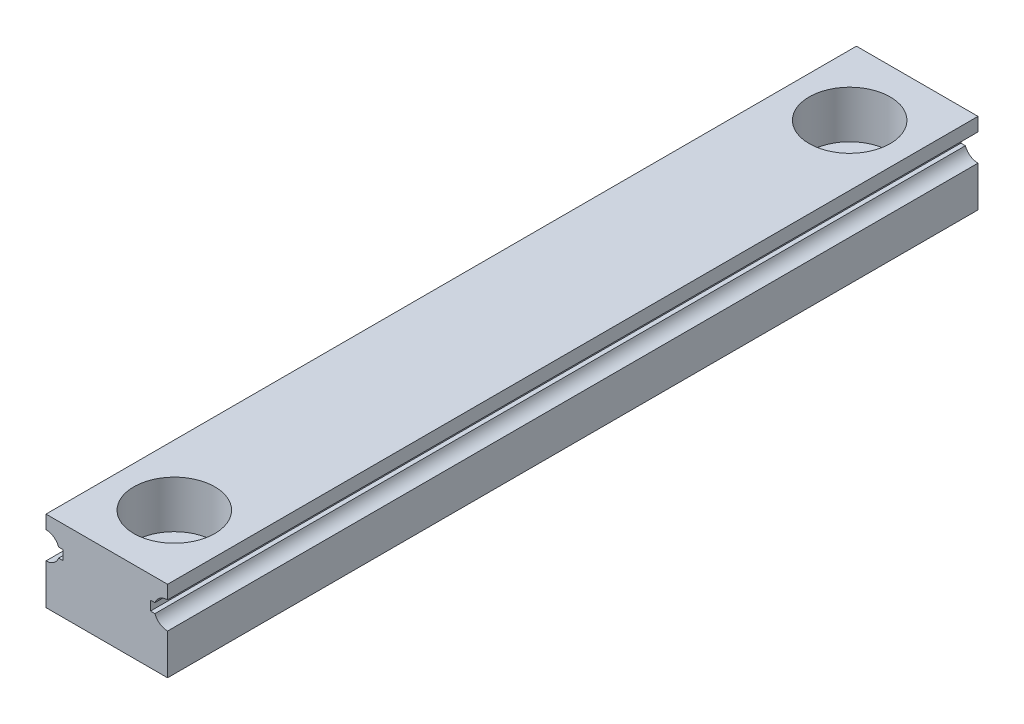
ISO-10303-21;
HEADER;
FILE_DESCRIPTION(('STEP AP214'),'2;1');
FILE_NAME('part.step','',(''),(''),'','','');
FILE_SCHEMA(('AUTOMOTIVE_DESIGN { 1 0 10303 214 1 1 1 1 }'));
ENDSEC;
DATA;
#1=APPLICATION_CONTEXT('core data for automotive mechanical design processes');
#2=APPLICATION_PROTOCOL_DEFINITION('international standard','automotive_design',2000,#1);
#3=PRODUCT_CONTEXT('',#1,'mechanical');
#4=PRODUCT('Part','Part','',(#3));
#5=PRODUCT_RELATED_PRODUCT_CATEGORY('part','',(#4));
#6=PRODUCT_DEFINITION_FORMATION('','',#4);
#7=PRODUCT_DEFINITION_CONTEXT('part definition',#1,'design');
#8=PRODUCT_DEFINITION('design','',#6,#7);
#9=PRODUCT_DEFINITION_SHAPE('','',#8);
#10=(LENGTH_UNIT() NAMED_UNIT(*) SI_UNIT(.MILLI.,.METRE.));
#11=(NAMED_UNIT(*) PLANE_ANGLE_UNIT() SI_UNIT($,.RADIAN.));
#12=(NAMED_UNIT(*) SI_UNIT($,.STERADIAN.) SOLID_ANGLE_UNIT());
#13=UNCERTAINTY_MEASURE_WITH_UNIT(LENGTH_MEASURE(1.E-05),#10,'distance_accuracy_value','');
#14=(GEOMETRIC_REPRESENTATION_CONTEXT(3) GLOBAL_UNCERTAINTY_ASSIGNED_CONTEXT((#13)) GLOBAL_UNIT_ASSIGNED_CONTEXT((#10,
#11,#12)) REPRESENTATION_CONTEXT('',''));
#15=CARTESIAN_POINT('',(0.,0.,0.));
#16=DIRECTION('',(0.,0.,1.));
#17=DIRECTION('',(1.,0.,0.));
#18=AXIS2_PLACEMENT_3D('',#15,#16,#17);
#19=CARTESIAN_POINT('',(4.5,2.,60.));
#20=DIRECTION('',(-1.,0.,0.));
#21=DIRECTION('',(0.,-1.,0.));
#22=AXIS2_PLACEMENT_3D('',#19,#20,#21);
#23=PLANE('',#22);
#24=DIRECTION('',(0.,1.,0.));
#25=VECTOR('',#24,1.);
#26=CARTESIAN_POINT('',(4.5,2.,0.));
#27=LINE('',#26,#25);
#28=CARTESIAN_POINT('',(4.5,2.,0.));
#29=VERTEX_POINT('',#28);
#30=CARTESIAN_POINT('',(4.5,3.,0.));
#31=VERTEX_POINT('',#30);
#32=EDGE_CURVE('E181',#29,#31,#27,.T.);
#33=ORIENTED_EDGE('',*,*,#32,.T.);
#34=DIRECTION('',(0.,0.,-1.));
#35=VECTOR('',#34,1.);
#36=CARTESIAN_POINT('',(4.5,3.,60.));
#37=LINE('',#36,#35);
#38=CARTESIAN_POINT('',(4.5,3.,60.));
#39=VERTEX_POINT('',#38);
#40=EDGE_CURVE('E11',#39,#31,#37,.T.);
#41=ORIENTED_EDGE('',*,*,#40,.F.);
#42=DIRECTION('',(0.,1.,0.));
#43=VECTOR('',#42,1.);
#44=CARTESIAN_POINT('',(4.5,2.,60.));
#45=LINE('',#44,#43);
#46=CARTESIAN_POINT('',(4.5,2.,60.));
#47=VERTEX_POINT('',#46);
#48=EDGE_CURVE('E212',#47,#39,#45,.T.);
#49=ORIENTED_EDGE('',*,*,#48,.F.);
#50=DIRECTION('',(0.,0.,-1.));
#51=VECTOR('',#50,1.);
#52=CARTESIAN_POINT('',(4.5,2.,60.));
#53=LINE('',#52,#51);
#54=EDGE_CURVE('E177',#47,#29,#53,.T.);
#55=ORIENTED_EDGE('',*,*,#54,.T.);
#56=EDGE_LOOP('',(#33,#41,#49,#55));
#57=FACE_BOUND('',#56,.T.);
#58=ADVANCED_FACE('F35',(#57),#23,.F.);
#59=CARTESIAN_POINT('',(-4.5,3.,60.));
#60=DIRECTION('',(0.,-1.,0.));
#61=DIRECTION('',(0.,0.,-1.));
#62=AXIS2_PLACEMENT_3D('',#59,#60,#61);
#63=PLANE('',#62);
#64=CARTESIAN_POINT('',(0.,3.,55.));
#65=DIRECTION('',(0.,1.,0.));
#66=DIRECTION('',(0.,0.,1.));
#67=AXIS2_PLACEMENT_3D('',#64,#65,#66);
#68=CIRCLE('',#67,3.);
#69=CARTESIAN_POINT('',(0.,3.,58.));
#70=VERTEX_POINT('',#69);
#71=EDGE_CURVE('E261',#70,#70,#68,.T.);
#72=ORIENTED_EDGE('',*,*,#71,.F.);
#73=EDGE_LOOP('',(#72));
#74=FACE_BOUND('',#73,.T.);
#75=CARTESIAN_POINT('',(0.,3.,5.));
#76=DIRECTION('',(0.,1.,0.));
#77=DIRECTION('',(0.,0.,1.));
#78=AXIS2_PLACEMENT_3D('',#75,#76,#77);
#79=CIRCLE('',#78,3.);
#80=CARTESIAN_POINT('',(0.,3.,8.));
#81=VERTEX_POINT('',#80);
#82=EDGE_CURVE('E249',#81,#81,#79,.T.);
#83=ORIENTED_EDGE('',*,*,#82,.F.);
#84=EDGE_LOOP('',(#83));
#85=FACE_BOUND('',#84,.T.);
#86=DIRECTION('',(-1.,0.,0.));
#87=VECTOR('',#86,1.);
#88=CARTESIAN_POINT('',(-4.5,3.,0.));
#89=LINE('',#88,#87);
#90=CARTESIAN_POINT('',(-4.5,3.,0.));
#91=VERTEX_POINT('',#90);
#92=EDGE_CURVE('E184',#31,#91,#89,.T.);
#93=ORIENTED_EDGE('',*,*,#92,.T.);
#94=DIRECTION('',(0.,0.,-1.));
#95=VECTOR('',#94,1.);
#96=CARTESIAN_POINT('',(-4.5,3.,60.));
#97=LINE('',#96,#95);
#98=CARTESIAN_POINT('',(-4.5,3.,60.));
#99=VERTEX_POINT('',#98);
#100=EDGE_CURVE('E44',#99,#91,#97,.T.);
#101=ORIENTED_EDGE('',*,*,#100,.F.);
#102=DIRECTION('',(-1.,0.,0.));
#103=VECTOR('',#102,1.);
#104=CARTESIAN_POINT('',(-4.5,3.,60.));
#105=LINE('',#104,#103);
#106=EDGE_CURVE('E120',#39,#99,#105,.T.);
#107=ORIENTED_EDGE('',*,*,#106,.F.);
#108=ORIENTED_EDGE('',*,*,#40,.T.);
#109=EDGE_LOOP('',(#93,#101,#107,#108));
#110=FACE_BOUND('',#109,.T.);
#111=ADVANCED_FACE('F316',(#74,#85,#110),#63,.F.);
#112=CARTESIAN_POINT('',(-4.5,2.,60.));
#113=DIRECTION('',(1.,0.,0.));
#114=DIRECTION('',(0.,1.,0.));
#115=AXIS2_PLACEMENT_3D('',#112,#113,#114);
#116=PLANE('',#115);
#117=DIRECTION('',(0.,-1.,0.));
#118=VECTOR('',#117,1.);
#119=CARTESIAN_POINT('',(-4.5,2.,0.));
#120=LINE('',#119,#118);
#121=CARTESIAN_POINT('',(-4.5,2.,0.));
#122=VERTEX_POINT('',#121);
#123=EDGE_CURVE('E187',#91,#122,#120,.T.);
#124=ORIENTED_EDGE('',*,*,#123,.T.);
#125=DIRECTION('',(0.,0.,-1.));
#126=VECTOR('',#125,1.);
#127=CARTESIAN_POINT('',(-4.5,2.,60.));
#128=LINE('',#127,#126);
#129=CARTESIAN_POINT('',(-4.5,2.,60.));
#130=VERTEX_POINT('',#129);
#131=EDGE_CURVE('E243',#130,#122,#128,.T.);
#132=ORIENTED_EDGE('',*,*,#131,.F.);
#133=DIRECTION('',(0.,-1.,0.));
#134=VECTOR('',#133,1.);
#135=CARTESIAN_POINT('',(-4.5,2.,60.));
#136=LINE('',#135,#134);
#137=EDGE_CURVE('E269',#99,#130,#136,.T.);
#138=ORIENTED_EDGE('',*,*,#137,.F.);
#139=ORIENTED_EDGE('',*,*,#100,.T.);
#140=EDGE_LOOP('',(#124,#132,#138,#139));
#141=FACE_BOUND('',#140,.T.);
#142=ADVANCED_FACE('F320',(#141),#116,.F.);
#143=CARTESIAN_POINT('',(-4.5,1.,60.));
#144=DIRECTION('',(0.,0.,-1.));
#145=DIRECTION('',(-1.,0.,0.));
#146=AXIS2_PLACEMENT_3D('',#143,#144,#145);
#147=CYLINDRICAL_SURFACE('',#146,1.);
#148=CARTESIAN_POINT('',(-4.5,1.,0.));
#149=DIRECTION('',(0.,0.,-1.));
#150=DIRECTION('',(1.,0.,0.));
#151=AXIS2_PLACEMENT_3D('',#148,#149,#150);
#152=CIRCLE('',#151,1.);
#153=CARTESIAN_POINT('',(-3.56399113733362,1.35197643246386,0.));
#154=VERTEX_POINT('',#153);
#155=EDGE_CURVE('E189',#122,#154,#152,.T.);
#156=ORIENTED_EDGE('',*,*,#155,.T.);
#157=DIRECTION('',(0.,0.,-1.));
#158=VECTOR('',#157,1.);
#159=CARTESIAN_POINT('',(-3.56399113733362,1.35197643246386,60.));
#160=LINE('',#159,#158);
#161=CARTESIAN_POINT('',(-3.56399113733362,1.35197643246386,60.));
#162=VERTEX_POINT('',#161);
#163=EDGE_CURVE('E240',#162,#154,#160,.T.);
#164=ORIENTED_EDGE('',*,*,#163,.F.);
#165=CARTESIAN_POINT('',(-4.5,1.,60.));
#166=DIRECTION('',(0.,0.,-1.));
#167=DIRECTION('',(1.,0.,0.));
#168=AXIS2_PLACEMENT_3D('',#165,#166,#167);
#169=CIRCLE('',#168,1.);
#170=EDGE_CURVE('E271',#130,#162,#169,.T.);
#171=ORIENTED_EDGE('',*,*,#170,.F.);
#172=ORIENTED_EDGE('',*,*,#131,.T.);
#173=EDGE_LOOP('',(#156,#164,#171,#172));
#174=FACE_BOUND('',#173,.T.);
#175=ADVANCED_FACE('F325',(#174),#147,.F.);
#176=CARTESIAN_POINT('',(-3.56399113733362,1.35197643246386,60.));
#177=DIRECTION('',(0.,1.,0.));
#178=DIRECTION('',(0.,0.,1.));
#179=AXIS2_PLACEMENT_3D('',#176,#177,#178);
#180=PLANE('',#179);
#181=DIRECTION('',(1.,0.,0.));
#182=VECTOR('',#181,1.);
#183=CARTESIAN_POINT('',(-3.56399113733362,1.35197643246386,0.));
#184=LINE('',#183,#182);
#185=CARTESIAN_POINT('',(-3.23507302495561,1.35197643246386,0.));
#186=VERTEX_POINT('',#185);
#187=EDGE_CURVE('E191',#154,#186,#184,.T.);
#188=ORIENTED_EDGE('',*,*,#187,.T.);
#189=DIRECTION('',(0.,0.,-1.));
#190=VECTOR('',#189,1.);
#191=CARTESIAN_POINT('',(-3.23507302495561,1.35197643246386,60.));
#192=LINE('',#191,#190);
#193=CARTESIAN_POINT('',(-3.23507302495561,1.35197643246386,60.));
#194=VERTEX_POINT('',#193);
#195=EDGE_CURVE('E237',#194,#186,#192,.T.);
#196=ORIENTED_EDGE('',*,*,#195,.F.);
#197=DIRECTION('',(1.,0.,0.));
#198=VECTOR('',#197,1.);
#199=CARTESIAN_POINT('',(-3.56399113733362,1.35197643246386,60.));
#200=LINE('',#199,#198);
#201=EDGE_CURVE('E273',#162,#194,#200,.T.);
#202=ORIENTED_EDGE('',*,*,#201,.F.);
#203=ORIENTED_EDGE('',*,*,#163,.T.);
#204=EDGE_LOOP('',(#188,#196,#202,#203));
#205=FACE_BOUND('',#204,.T.);
#206=ADVANCED_FACE('F333',(#205),#180,.F.);
#207=CARTESIAN_POINT('',(-3.23507302495561,0.648023567536147,60.));
#208=DIRECTION('',(1.,0.,0.));
#209=DIRECTION('',(0.,0.,-1.));
#210=AXIS2_PLACEMENT_3D('',#207,#208,#209);
#211=PLANE('',#210);
#212=DIRECTION('',(0.,-1.,0.));
#213=VECTOR('',#212,1.);
#214=CARTESIAN_POINT('',(-3.23507302495561,0.648023567536147,0.));
#215=LINE('',#214,#213);
#216=CARTESIAN_POINT('',(-3.23507302495561,0.648023567536147,0.));
#217=VERTEX_POINT('',#216);
#218=EDGE_CURVE('E193',#186,#217,#215,.T.);
#219=ORIENTED_EDGE('',*,*,#218,.T.);
#220=DIRECTION('',(0.,0.,-1.));
#221=VECTOR('',#220,1.);
#222=CARTESIAN_POINT('',(-3.23507302495561,0.648023567536147,60.));
#223=LINE('',#222,#221);
#224=CARTESIAN_POINT('',(-3.23507302495561,0.648023567536147,60.));
#225=VERTEX_POINT('',#224);
#226=EDGE_CURVE('E234',#225,#217,#223,.T.);
#227=ORIENTED_EDGE('',*,*,#226,.F.);
#228=DIRECTION('',(0.,-1.,0.));
#229=VECTOR('',#228,1.);
#230=CARTESIAN_POINT('',(-3.23507302495561,0.648023567536147,60.));
#231=LINE('',#230,#229);
#232=EDGE_CURVE('E275',#194,#225,#231,.T.);
#233=ORIENTED_EDGE('',*,*,#232,.F.);
#234=ORIENTED_EDGE('',*,*,#195,.T.);
#235=EDGE_LOOP('',(#219,#227,#233,#234));
#236=FACE_BOUND('',#235,.T.);
#237=ADVANCED_FACE('F337',(#236),#211,.F.);
#238=CARTESIAN_POINT('',(-3.56399113733362,0.648023567536147,60.));
#239=DIRECTION('',(0.,-1.,0.));
#240=DIRECTION('',(0.,0.,-1.));
#241=AXIS2_PLACEMENT_3D('',#238,#239,#240);
#242=PLANE('',#241);
#243=DIRECTION('',(-1.,0.,0.));
#244=VECTOR('',#243,1.);
#245=CARTESIAN_POINT('',(-3.56399113733362,0.648023567536147,0.));
#246=LINE('',#245,#244);
#247=CARTESIAN_POINT('',(-3.56399113733362,0.648023567536147,0.));
#248=VERTEX_POINT('',#247);
#249=EDGE_CURVE('E195',#217,#248,#246,.T.);
#250=ORIENTED_EDGE('',*,*,#249,.T.);
#251=DIRECTION('',(0.,0.,-1.));
#252=VECTOR('',#251,1.);
#253=CARTESIAN_POINT('',(-3.56399113733362,0.648023567536147,60.));
#254=LINE('',#253,#252);
#255=CARTESIAN_POINT('',(-3.56399113733362,0.648023567536147,60.));
#256=VERTEX_POINT('',#255);
#257=EDGE_CURVE('E231',#256,#248,#254,.T.);
#258=ORIENTED_EDGE('',*,*,#257,.F.);
#259=DIRECTION('',(-1.,0.,0.));
#260=VECTOR('',#259,1.);
#261=CARTESIAN_POINT('',(-3.56399113733362,0.648023567536147,60.));
#262=LINE('',#261,#260);
#263=EDGE_CURVE('E277',#225,#256,#262,.T.);
#264=ORIENTED_EDGE('',*,*,#263,.F.);
#265=ORIENTED_EDGE('',*,*,#226,.T.);
#266=EDGE_LOOP('',(#250,#258,#264,#265));
#267=FACE_BOUND('',#266,.T.);
#268=ADVANCED_FACE('F341',(#267),#242,.F.);
#269=CARTESIAN_POINT('',(-4.5,1.,60.));
#270=DIRECTION('',(0.,0.,-1.));
#271=DIRECTION('',(-1.,0.,0.));
#272=AXIS2_PLACEMENT_3D('',#269,#270,#271);
#273=CYLINDRICAL_SURFACE('',#272,1.);
#274=CARTESIAN_POINT('',(-4.5,1.,0.));
#275=DIRECTION('',(0.,0.,-1.));
#276=DIRECTION('',(1.,0.,0.));
#277=AXIS2_PLACEMENT_3D('',#274,#275,#276);
#278=CIRCLE('',#277,1.);
#279=CARTESIAN_POINT('',(-4.5,0.,0.));
#280=VERTEX_POINT('',#279);
#281=EDGE_CURVE('E197',#248,#280,#278,.T.);
#282=ORIENTED_EDGE('',*,*,#281,.T.);
#283=DIRECTION('',(0.,0.,-1.));
#284=VECTOR('',#283,1.);
#285=CARTESIAN_POINT('',(-4.5,0.,60.));
#286=LINE('',#285,#284);
#287=CARTESIAN_POINT('',(-4.5,0.,60.));
#288=VERTEX_POINT('',#287);
#289=EDGE_CURVE('E228',#288,#280,#286,.T.);
#290=ORIENTED_EDGE('',*,*,#289,.F.);
#291=CARTESIAN_POINT('',(-4.5,1.,60.));
#292=DIRECTION('',(0.,0.,-1.));
#293=DIRECTION('',(1.,0.,0.));
#294=AXIS2_PLACEMENT_3D('',#291,#292,#293);
#295=CIRCLE('',#294,1.);
#296=EDGE_CURVE('E279',#256,#288,#295,.T.);
#297=ORIENTED_EDGE('',*,*,#296,.F.);
#298=ORIENTED_EDGE('',*,*,#257,.T.);
#299=EDGE_LOOP('',(#282,#290,#297,#298));
#300=FACE_BOUND('',#299,.T.);
#301=ADVANCED_FACE('F345',(#300),#273,.F.);
#302=CARTESIAN_POINT('',(-4.5,-3.,60.));
#303=DIRECTION('',(1.,0.,0.));
#304=DIRECTION('',(0.,0.,-1.));
#305=AXIS2_PLACEMENT_3D('',#302,#303,#304);
#306=PLANE('',#305);
#307=DIRECTION('',(0.,-1.,0.));
#308=VECTOR('',#307,1.);
#309=CARTESIAN_POINT('',(-4.5,-3.,0.));
#310=LINE('',#309,#308);
#311=CARTESIAN_POINT('',(-4.5,-3.,0.));
#312=VERTEX_POINT('',#311);
#313=EDGE_CURVE('E199',#280,#312,#310,.T.);
#314=ORIENTED_EDGE('',*,*,#313,.T.);
#315=DIRECTION('',(0.,0.,-1.));
#316=VECTOR('',#315,1.);
#317=CARTESIAN_POINT('',(-4.5,-3.,60.));
#318=LINE('',#317,#316);
#319=CARTESIAN_POINT('',(-4.5,-3.,60.));
#320=VERTEX_POINT('',#319);
#321=EDGE_CURVE('E225',#320,#312,#318,.T.);
#322=ORIENTED_EDGE('',*,*,#321,.F.);
#323=DIRECTION('',(0.,-1.,0.));
#324=VECTOR('',#323,1.);
#325=CARTESIAN_POINT('',(-4.5,-3.,60.));
#326=LINE('',#325,#324);
#327=EDGE_CURVE('E281',#288,#320,#326,.T.);
#328=ORIENTED_EDGE('',*,*,#327,.F.);
#329=ORIENTED_EDGE('',*,*,#289,.T.);
#330=EDGE_LOOP('',(#314,#322,#328,#329));
#331=FACE_BOUND('',#330,.T.);
#332=ADVANCED_FACE('F349',(#331),#306,.F.);
#333=CARTESIAN_POINT('',(-4.5,-3.,60.));
#334=DIRECTION('',(0.,1.,0.));
#335=DIRECTION('',(-1.,0.,0.));
#336=AXIS2_PLACEMENT_3D('',#333,#334,#335);
#337=PLANE('',#336);
#338=CARTESIAN_POINT('',(0.,-3.,55.));
#339=DIRECTION('',(0.,1.,0.));
#340=DIRECTION('',(0.,0.,1.));
#341=AXIS2_PLACEMENT_3D('',#338,#339,#340);
#342=CIRCLE('',#341,1.75);
#343=CARTESIAN_POINT('',(0.,-3.,56.75));
#344=VERTEX_POINT('',#343);
#345=EDGE_CURVE('E474',#344,#344,#342,.T.);
#346=ORIENTED_EDGE('',*,*,#345,.T.);
#347=EDGE_LOOP('',(#346));
#348=FACE_BOUND('',#347,.T.);
#349=CARTESIAN_POINT('',(0.,-3.,5.));
#350=DIRECTION('',(0.,1.,0.));
#351=DIRECTION('',(0.,0.,1.));
#352=AXIS2_PLACEMENT_3D('',#349,#350,#351);
#353=CIRCLE('',#352,1.75);
#354=CARTESIAN_POINT('',(0.,-3.,6.75));
#355=VERTEX_POINT('',#354);
#356=EDGE_CURVE('E250',#355,#355,#353,.T.);
#357=ORIENTED_EDGE('',*,*,#356,.T.);
#358=EDGE_LOOP('',(#357));
#359=FACE_BOUND('',#358,.T.);
#360=DIRECTION('',(1.,0.,0.));
#361=VECTOR('',#360,1.);
#362=CARTESIAN_POINT('',(-4.5,-3.,0.));
#363=LINE('',#362,#361);
#364=CARTESIAN_POINT('',(4.5,-3.,0.));
#365=VERTEX_POINT('',#364);
#366=EDGE_CURVE('E201',#312,#365,#363,.T.);
#367=ORIENTED_EDGE('',*,*,#366,.T.);
#368=DIRECTION('',(0.,0.,-1.));
#369=VECTOR('',#368,1.);
#370=CARTESIAN_POINT('',(4.5,-3.,60.));
#371=LINE('',#370,#369);
#372=CARTESIAN_POINT('',(4.5,-3.,60.));
#373=VERTEX_POINT('',#372);
#374=EDGE_CURVE('E222',#373,#365,#371,.T.);
#375=ORIENTED_EDGE('',*,*,#374,.F.);
#376=DIRECTION('',(1.,0.,0.));
#377=VECTOR('',#376,1.);
#378=CARTESIAN_POINT('',(-4.5,-3.,60.));
#379=LINE('',#378,#377);
#380=EDGE_CURVE('E283',#320,#373,#379,.T.);
#381=ORIENTED_EDGE('',*,*,#380,.F.);
#382=ORIENTED_EDGE('',*,*,#321,.T.);
#383=EDGE_LOOP('',(#367,#375,#381,#382));
#384=FACE_BOUND('',#383,.T.);
#385=ADVANCED_FACE('F353',(#348,#359,#384),#337,.F.);
#386=CARTESIAN_POINT('',(4.5,-3.,60.));
#387=DIRECTION('',(-1.,0.,0.));
#388=DIRECTION('',(0.,-1.,0.));
#389=AXIS2_PLACEMENT_3D('',#386,#387,#388);
#390=PLANE('',#389);
#391=DIRECTION('',(0.,1.,0.));
#392=VECTOR('',#391,1.);
#393=CARTESIAN_POINT('',(4.5,-3.,0.));
#394=LINE('',#393,#392);
#395=CARTESIAN_POINT('',(4.5,0.,0.));
#396=VERTEX_POINT('',#395);
#397=EDGE_CURVE('E203',#365,#396,#394,.T.);
#398=ORIENTED_EDGE('',*,*,#397,.T.);
#399=DIRECTION('',(0.,0.,-1.));
#400=VECTOR('',#399,1.);
#401=CARTESIAN_POINT('',(4.5,0.,60.));
#402=LINE('',#401,#400);
#403=CARTESIAN_POINT('',(4.5,0.,60.));
#404=VERTEX_POINT('',#403);
#405=EDGE_CURVE('E219',#404,#396,#402,.T.);
#406=ORIENTED_EDGE('',*,*,#405,.F.);
#407=DIRECTION('',(0.,1.,0.));
#408=VECTOR('',#407,1.);
#409=CARTESIAN_POINT('',(4.5,-3.,60.));
#410=LINE('',#409,#408);
#411=EDGE_CURVE('E285',#373,#404,#410,.T.);
#412=ORIENTED_EDGE('',*,*,#411,.F.);
#413=ORIENTED_EDGE('',*,*,#374,.T.);
#414=EDGE_LOOP('',(#398,#406,#412,#413));
#415=FACE_BOUND('',#414,.T.);
#416=ADVANCED_FACE('F357',(#415),#390,.F.);
#417=CARTESIAN_POINT('',(4.5,1.,60.));
#418=DIRECTION('',(0.,0.,-1.));
#419=DIRECTION('',(-1.,0.,0.));
#420=AXIS2_PLACEMENT_3D('',#417,#418,#419);
#421=CYLINDRICAL_SURFACE('',#420,1.);
#422=CARTESIAN_POINT('',(4.5,1.,0.));
#423=DIRECTION('',(0.,0.,-1.));
#424=DIRECTION('',(-1.,0.,0.));
#425=AXIS2_PLACEMENT_3D('',#422,#423,#424);
#426=CIRCLE('',#425,1.);
#427=CARTESIAN_POINT('',(3.56399113733362,0.648023567536147,0.));
#428=VERTEX_POINT('',#427);
#429=EDGE_CURVE('E205',#396,#428,#426,.T.);
#430=ORIENTED_EDGE('',*,*,#429,.T.);
#431=DIRECTION('',(0.,0.,-1.));
#432=VECTOR('',#431,1.);
#433=CARTESIAN_POINT('',(3.56399113733362,0.648023567536147,60.));
#434=LINE('',#433,#432);
#435=CARTESIAN_POINT('',(3.56399113733362,0.648023567536147,60.));
#436=VERTEX_POINT('',#435);
#437=EDGE_CURVE('E216',#436,#428,#434,.T.);
#438=ORIENTED_EDGE('',*,*,#437,.F.);
#439=CARTESIAN_POINT('',(4.5,1.,60.));
#440=DIRECTION('',(0.,0.,-1.));
#441=DIRECTION('',(-1.,0.,0.));
#442=AXIS2_PLACEMENT_3D('',#439,#440,#441);
#443=CIRCLE('',#442,1.);
#444=EDGE_CURVE('E287',#404,#436,#443,.T.);
#445=ORIENTED_EDGE('',*,*,#444,.F.);
#446=ORIENTED_EDGE('',*,*,#405,.T.);
#447=EDGE_LOOP('',(#430,#438,#445,#446));
#448=FACE_BOUND('',#447,.T.);
#449=ADVANCED_FACE('F293',(#448),#421,.F.);
#450=CARTESIAN_POINT('',(3.56399113733362,0.648023567536147,60.));
#451=DIRECTION('',(0.,-1.,0.));
#452=DIRECTION('',(0.,0.,-1.));
#453=AXIS2_PLACEMENT_3D('',#450,#451,#452);
#454=PLANE('',#453);
#455=DIRECTION('',(-1.,0.,0.));
#456=VECTOR('',#455,1.);
#457=CARTESIAN_POINT('',(3.56399113733362,0.648023567536147,0.));
#458=LINE('',#457,#456);
#459=CARTESIAN_POINT('',(3.23507302495561,0.648023567536147,0.));
#460=VERTEX_POINT('',#459);
#461=EDGE_CURVE('E207',#428,#460,#458,.T.);
#462=ORIENTED_EDGE('',*,*,#461,.T.);
#463=DIRECTION('',(0.,0.,-1.));
#464=VECTOR('',#463,1.);
#465=CARTESIAN_POINT('',(3.23507302495561,0.648023567536147,60.));
#466=LINE('',#465,#464);
#467=CARTESIAN_POINT('',(3.23507302495561,0.648023567536147,60.));
#468=VERTEX_POINT('',#467);
#469=EDGE_CURVE('E172',#468,#460,#466,.T.);
#470=ORIENTED_EDGE('',*,*,#469,.F.);
#471=DIRECTION('',(-1.,0.,0.));
#472=VECTOR('',#471,1.);
#473=CARTESIAN_POINT('',(3.56399113733362,0.648023567536147,60.));
#474=LINE('',#473,#472);
#475=EDGE_CURVE('E163',#436,#468,#474,.T.);
#476=ORIENTED_EDGE('',*,*,#475,.F.);
#477=ORIENTED_EDGE('',*,*,#437,.T.);
#478=EDGE_LOOP('',(#462,#470,#476,#477));
#479=FACE_BOUND('',#478,.T.);
#480=ADVANCED_FACE('F297',(#479),#454,.F.);
#481=CARTESIAN_POINT('',(3.23507302495561,0.648023567536147,60.));
#482=DIRECTION('',(-1.,0.,0.));
#483=DIRECTION('',(0.,0.,1.));
#484=AXIS2_PLACEMENT_3D('',#481,#482,#483);
#485=PLANE('',#484);
#486=DIRECTION('',(0.,1.,0.));
#487=VECTOR('',#486,1.);
#488=CARTESIAN_POINT('',(3.23507302495561,0.648023567536147,0.));
#489=LINE('',#488,#487);
#490=CARTESIAN_POINT('',(3.23507302495561,1.35197643246386,0.));
#491=VERTEX_POINT('',#490);
#492=EDGE_CURVE('E171',#460,#491,#489,.T.);
#493=ORIENTED_EDGE('',*,*,#492,.T.);
#494=DIRECTION('',(0.,0.,-1.));
#495=VECTOR('',#494,1.);
#496=CARTESIAN_POINT('',(3.23507302495561,1.35197643246386,60.));
#497=LINE('',#496,#495);
#498=CARTESIAN_POINT('',(3.23507302495561,1.35197643246386,60.));
#499=VERTEX_POINT('',#498);
#500=EDGE_CURVE('E168',#499,#491,#497,.T.);
#501=ORIENTED_EDGE('',*,*,#500,.F.);
#502=DIRECTION('',(0.,1.,0.));
#503=VECTOR('',#502,1.);
#504=CARTESIAN_POINT('',(3.23507302495561,0.648023567536147,60.));
#505=LINE('',#504,#503);
#506=EDGE_CURVE('E157',#468,#499,#505,.T.);
#507=ORIENTED_EDGE('',*,*,#506,.F.);
#508=ORIENTED_EDGE('',*,*,#469,.T.);
#509=EDGE_LOOP('',(#493,#501,#507,#508));
#510=FACE_BOUND('',#509,.T.);
#511=ADVANCED_FACE('F169',(#510),#485,.F.);
#512=CARTESIAN_POINT('',(3.56399113733362,1.35197643246386,60.));
#513=DIRECTION('',(0.,1.,0.));
#514=DIRECTION('',(0.,0.,1.));
#515=AXIS2_PLACEMENT_3D('',#512,#513,#514);
#516=PLANE('',#515);
#517=DIRECTION('',(1.,0.,0.));
#518=VECTOR('',#517,1.);
#519=CARTESIAN_POINT('',(3.56399113733362,1.35197643246386,0.));
#520=LINE('',#519,#518);
#521=CARTESIAN_POINT('',(3.56399113733362,1.35197643246386,0.));
#522=VERTEX_POINT('',#521);
#523=EDGE_CURVE('E106',#491,#522,#520,.T.);
#524=ORIENTED_EDGE('',*,*,#523,.T.);
#525=DIRECTION('',(0.,0.,-1.));
#526=VECTOR('',#525,1.);
#527=CARTESIAN_POINT('',(3.56399113733362,1.35197643246386,60.));
#528=LINE('',#527,#526);
#529=CARTESIAN_POINT('',(3.56399113733362,1.35197643246386,60.));
#530=VERTEX_POINT('',#529);
#531=EDGE_CURVE('E173',#530,#522,#528,.T.);
#532=ORIENTED_EDGE('',*,*,#531,.F.);
#533=DIRECTION('',(1.,0.,0.));
#534=VECTOR('',#533,1.);
#535=CARTESIAN_POINT('',(3.56399113733362,1.35197643246386,60.));
#536=LINE('',#535,#534);
#537=EDGE_CURVE('E161',#499,#530,#536,.T.);
#538=ORIENTED_EDGE('',*,*,#537,.F.);
#539=ORIENTED_EDGE('',*,*,#500,.T.);
#540=EDGE_LOOP('',(#524,#532,#538,#539));
#541=FACE_BOUND('',#540,.T.);
#542=ADVANCED_FACE('F175',(#541),#516,.F.);
#543=CARTESIAN_POINT('',(4.5,1.,60.));
#544=DIRECTION('',(0.,0.,-1.));
#545=DIRECTION('',(-1.,0.,0.));
#546=AXIS2_PLACEMENT_3D('',#543,#544,#545);
#547=CYLINDRICAL_SURFACE('',#546,1.);
#548=CARTESIAN_POINT('',(4.5,1.,0.));
#549=DIRECTION('',(0.,0.,-1.));
#550=DIRECTION('',(-1.,0.,0.));
#551=AXIS2_PLACEMENT_3D('',#548,#549,#550);
#552=CIRCLE('',#551,1.);
#553=EDGE_CURVE('E112',#522,#29,#552,.T.);
#554=ORIENTED_EDGE('',*,*,#553,.T.);
#555=ORIENTED_EDGE('',*,*,#54,.F.);
#556=CARTESIAN_POINT('',(4.5,1.,60.));
#557=DIRECTION('',(0.,0.,-1.));
#558=DIRECTION('',(-1.,0.,0.));
#559=AXIS2_PLACEMENT_3D('',#556,#557,#558);
#560=CIRCLE('',#559,1.);
#561=EDGE_CURVE('E53',#530,#47,#560,.T.);
#562=ORIENTED_EDGE('',*,*,#561,.F.);
#563=ORIENTED_EDGE('',*,*,#531,.T.);
#564=EDGE_LOOP('',(#554,#555,#562,#563));
#565=FACE_BOUND('',#564,.T.);
#566=ADVANCED_FACE('F305',(#565),#547,.F.);
#567=CARTESIAN_POINT('',(-4.5,1.,60.));
#568=DIRECTION('',(0.,0.,1.));
#569=DIRECTION('',(1.,0.,0.));
#570=AXIS2_PLACEMENT_3D('',#567,#568,#569);
#571=PLANE('',#570);
#572=ORIENTED_EDGE('',*,*,#48,.T.);
#573=ORIENTED_EDGE('',*,*,#106,.T.);
#574=ORIENTED_EDGE('',*,*,#137,.T.);
#575=ORIENTED_EDGE('',*,*,#170,.T.);
#576=ORIENTED_EDGE('',*,*,#201,.T.);
#577=ORIENTED_EDGE('',*,*,#232,.T.);
#578=ORIENTED_EDGE('',*,*,#263,.T.);
#579=ORIENTED_EDGE('',*,*,#296,.T.);
#580=ORIENTED_EDGE('',*,*,#327,.T.);
#581=ORIENTED_EDGE('',*,*,#380,.T.);
#582=ORIENTED_EDGE('',*,*,#411,.T.);
#583=ORIENTED_EDGE('',*,*,#444,.T.);
#584=ORIENTED_EDGE('',*,*,#475,.T.);
#585=ORIENTED_EDGE('',*,*,#506,.T.);
#586=ORIENTED_EDGE('',*,*,#537,.T.);
#587=ORIENTED_EDGE('',*,*,#561,.T.);
#588=EDGE_LOOP('',(#572,#573,#574,#575,#576,#577,#578,#579,#580,#581,#582,#583,#584,#585,#586,#587));
#589=FACE_BOUND('',#588,.T.);
#590=ADVANCED_FACE('F159',(#589),#571,.T.);
#591=CARTESIAN_POINT('',(-4.5,1.,0.));
#592=DIRECTION('',(0.,0.,1.));
#593=DIRECTION('',(1.,0.,0.));
#594=AXIS2_PLACEMENT_3D('',#591,#592,#593);
#595=PLANE('',#594);
#596=ORIENTED_EDGE('',*,*,#32,.F.);
#597=ORIENTED_EDGE('',*,*,#553,.F.);
#598=ORIENTED_EDGE('',*,*,#523,.F.);
#599=ORIENTED_EDGE('',*,*,#492,.F.);
#600=ORIENTED_EDGE('',*,*,#461,.F.);
#601=ORIENTED_EDGE('',*,*,#429,.F.);
#602=ORIENTED_EDGE('',*,*,#397,.F.);
#603=ORIENTED_EDGE('',*,*,#366,.F.);
#604=ORIENTED_EDGE('',*,*,#313,.F.);
#605=ORIENTED_EDGE('',*,*,#281,.F.);
#606=ORIENTED_EDGE('',*,*,#249,.F.);
#607=ORIENTED_EDGE('',*,*,#218,.F.);
#608=ORIENTED_EDGE('',*,*,#187,.F.);
#609=ORIENTED_EDGE('',*,*,#155,.F.);
#610=ORIENTED_EDGE('',*,*,#123,.F.);
#611=ORIENTED_EDGE('',*,*,#92,.F.);
#612=EDGE_LOOP('',(#596,#597,#598,#599,#600,#601,#602,#603,#604,#605,#606,#607,#608,#609,#610,#611));
#613=FACE_BOUND('',#612,.T.);
#614=ADVANCED_FACE('F300',(#613),#595,.F.);
#615=CARTESIAN_POINT('',(0.,-0.499999999999999,5.));
#616=DIRECTION('',(0.,1.,0.));
#617=DIRECTION('',(0.,0.,1.));
#618=AXIS2_PLACEMENT_3D('',#615,#616,#617);
#619=CYLINDRICAL_SURFACE('',#618,3.);
#620=CARTESIAN_POINT('',(0.,-0.499999999999999,5.));
#621=DIRECTION('',(0.,1.,0.));
#622=DIRECTION('',(0.,0.,1.));
#623=AXIS2_PLACEMENT_3D('',#620,#621,#622);
#624=CIRCLE('',#623,3.);
#625=CARTESIAN_POINT('',(0.,-0.499999999999999,8.));
#626=VERTEX_POINT('',#625);
#627=EDGE_CURVE('E185',#626,#626,#624,.T.);
#628=ORIENTED_EDGE('',*,*,#627,.F.);
#629=EDGE_LOOP('',(#628));
#630=FACE_BOUND('',#629,.T.);
#631=ORIENTED_EDGE('',*,*,#82,.T.);
#632=EDGE_LOOP('',(#631));
#633=FACE_BOUND('',#632,.T.);
#634=ADVANCED_FACE('F394',(#630,#633),#619,.F.);
#635=CARTESIAN_POINT('',(0.,-0.499999999999999,5.));
#636=DIRECTION('',(0.,1.,0.));
#637=DIRECTION('',(0.,0.,1.));
#638=AXIS2_PLACEMENT_3D('',#635,#636,#637);
#639=PLANE('',#638);
#640=CARTESIAN_POINT('',(0.,-0.499999999999999,5.));
#641=DIRECTION('',(0.,1.,0.));
#642=DIRECTION('',(0.,0.,1.));
#643=AXIS2_PLACEMENT_3D('',#640,#641,#642);
#644=CIRCLE('',#643,1.75);
#645=CARTESIAN_POINT('',(0.,-0.499999999999999,6.75));
#646=VERTEX_POINT('',#645);
#647=EDGE_CURVE('E247',#646,#646,#644,.T.);
#648=ORIENTED_EDGE('',*,*,#647,.F.);
#649=EDGE_LOOP('',(#648));
#650=FACE_BOUND('',#649,.T.);
#651=ORIENTED_EDGE('',*,*,#627,.T.);
#652=EDGE_LOOP('',(#651));
#653=FACE_BOUND('',#652,.T.);
#654=ADVANCED_FACE('F402',(#650,#653),#639,.T.);
#655=CARTESIAN_POINT('',(0.,-3.,5.));
#656=DIRECTION('',(0.,1.,0.));
#657=DIRECTION('',(0.,0.,1.));
#658=AXIS2_PLACEMENT_3D('',#655,#656,#657);
#659=CYLINDRICAL_SURFACE('',#658,1.75);
#660=ORIENTED_EDGE('',*,*,#647,.T.);
#661=EDGE_LOOP('',(#660));
#662=FACE_BOUND('',#661,.T.);
#663=ORIENTED_EDGE('',*,*,#356,.F.);
#664=EDGE_LOOP('',(#663));
#665=FACE_BOUND('',#664,.T.);
#666=ADVANCED_FACE('F412',(#662,#665),#659,.F.);
#667=CARTESIAN_POINT('',(0.,-0.499999999999999,55.));
#668=DIRECTION('',(0.,1.,0.));
#669=DIRECTION('',(0.,0.,1.));
#670=AXIS2_PLACEMENT_3D('',#667,#668,#669);
#671=CYLINDRICAL_SURFACE('',#670,3.);
#672=CARTESIAN_POINT('',(0.,-0.499999999999999,55.));
#673=DIRECTION('',(0.,1.,0.));
#674=DIRECTION('',(0.,0.,1.));
#675=AXIS2_PLACEMENT_3D('',#672,#673,#674);
#676=CIRCLE('',#675,3.);
#677=CARTESIAN_POINT('',(0.,-0.499999999999999,58.));
#678=VERTEX_POINT('',#677);
#679=EDGE_CURVE('E256',#678,#678,#676,.T.);
#680=ORIENTED_EDGE('',*,*,#679,.F.);
#681=EDGE_LOOP('',(#680));
#682=FACE_BOUND('',#681,.T.);
#683=ORIENTED_EDGE('',*,*,#71,.T.);
#684=EDGE_LOOP('',(#683));
#685=FACE_BOUND('',#684,.T.);
#686=ADVANCED_FACE('F421',(#682,#685),#671,.F.);
#687=CARTESIAN_POINT('',(0.,-0.499999999999999,55.));
#688=DIRECTION('',(0.,1.,0.));
#689=DIRECTION('',(0.,0.,1.));
#690=AXIS2_PLACEMENT_3D('',#687,#688,#689);
#691=PLANE('',#690);
#692=CARTESIAN_POINT('',(0.,-0.499999999999999,55.));
#693=DIRECTION('',(0.,1.,0.));
#694=DIRECTION('',(0.,0.,1.));
#695=AXIS2_PLACEMENT_3D('',#692,#693,#694);
#696=CIRCLE('',#695,1.75);
#697=CARTESIAN_POINT('',(0.,-0.499999999999999,56.75));
#698=VERTEX_POINT('',#697);
#699=EDGE_CURVE('E38',#698,#698,#696,.T.);
#700=ORIENTED_EDGE('',*,*,#699,.F.);
#701=EDGE_LOOP('',(#700));
#702=FACE_BOUND('',#701,.T.);
#703=ORIENTED_EDGE('',*,*,#679,.T.);
#704=EDGE_LOOP('',(#703));
#705=FACE_BOUND('',#704,.T.);
#706=ADVANCED_FACE('F445',(#702,#705),#691,.T.);
#707=CARTESIAN_POINT('',(0.,-3.,55.));
#708=DIRECTION('',(0.,1.,0.));
#709=DIRECTION('',(0.,0.,1.));
#710=AXIS2_PLACEMENT_3D('',#707,#708,#709);
#711=CYLINDRICAL_SURFACE('',#710,1.75);
#712=ORIENTED_EDGE('',*,*,#699,.T.);
#713=EDGE_LOOP('',(#712));
#714=FACE_BOUND('',#713,.T.);
#715=ORIENTED_EDGE('',*,*,#345,.F.);
#716=EDGE_LOOP('',(#715));
#717=FACE_BOUND('',#716,.T.);
#718=ADVANCED_FACE('F455',(#714,#717),#711,.F.);
#719=CLOSED_SHELL('',(#58,#111,#142,#175,#206,#237,#268,#301,#332,#385,#416,#449,#480,#511,#542,
#566,#590,#614,#634,#654,#666,#686,#706,#718));
#720=MANIFOLD_SOLID_BREP('B2',#719);
#721=ADVANCED_BREP_SHAPE_REPRESENTATION('',(#18,#720),#14);
#722=SHAPE_DEFINITION_REPRESENTATION(#9,#721);
ENDSEC;
END-ISO-10303-21;
